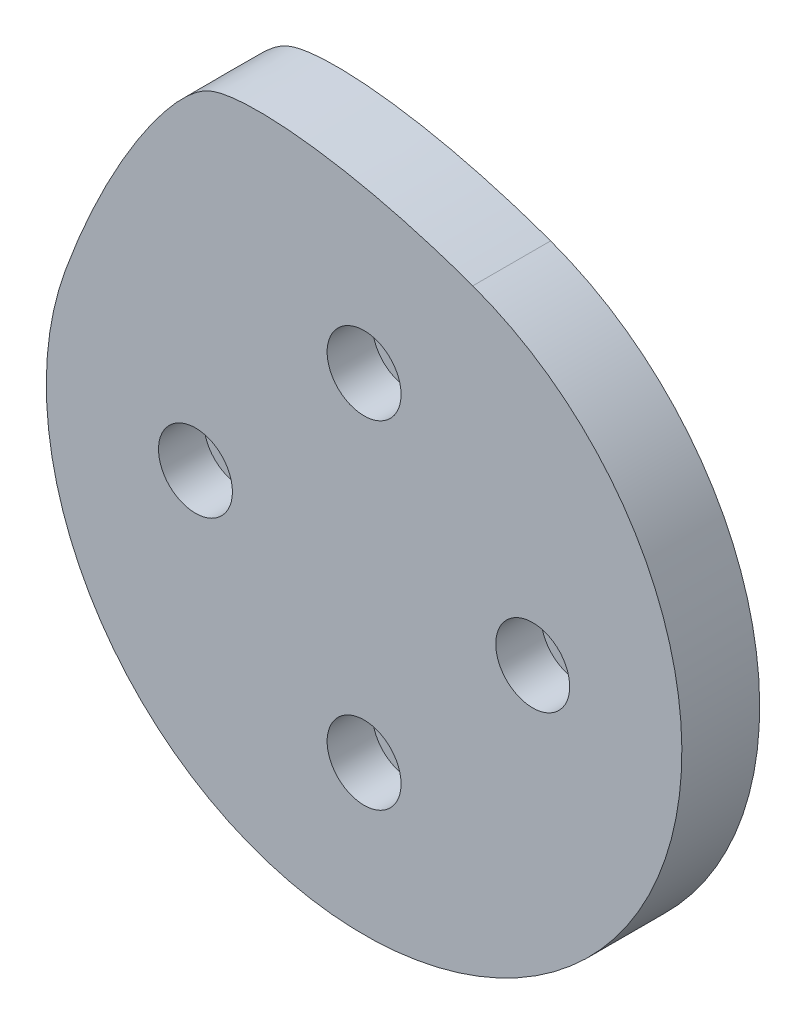
ISO-10303-21;
HEADER;
FILE_DESCRIPTION(('STEP AP214'),'2;1');
FILE_NAME('part.step','',(''),(''),'','','');
FILE_SCHEMA(('AUTOMOTIVE_DESIGN { 1 0 10303 214 1 1 1 1 }'));
ENDSEC;
DATA;
#1=APPLICATION_CONTEXT('core data for automotive mechanical design processes');
#2=APPLICATION_PROTOCOL_DEFINITION('international standard','automotive_design',2000,#1);
#3=PRODUCT_CONTEXT('',#1,'mechanical');
#4=PRODUCT('Part','Part','',(#3));
#5=PRODUCT_RELATED_PRODUCT_CATEGORY('part','',(#4));
#6=PRODUCT_DEFINITION_FORMATION('','',#4);
#7=PRODUCT_DEFINITION_CONTEXT('part definition',#1,'design');
#8=PRODUCT_DEFINITION('design','',#6,#7);
#9=PRODUCT_DEFINITION_SHAPE('','',#8);
#10=(LENGTH_UNIT() NAMED_UNIT(*) SI_UNIT(.MILLI.,.METRE.));
#11=(NAMED_UNIT(*) PLANE_ANGLE_UNIT() SI_UNIT($,.RADIAN.));
#12=(NAMED_UNIT(*) SI_UNIT($,.STERADIAN.) SOLID_ANGLE_UNIT());
#13=UNCERTAINTY_MEASURE_WITH_UNIT(LENGTH_MEASURE(1.E-05),#10,'distance_accuracy_value','');
#14=(GEOMETRIC_REPRESENTATION_CONTEXT(3) GLOBAL_UNCERTAINTY_ASSIGNED_CONTEXT((#13)) GLOBAL_UNIT_ASSIGNED_CONTEXT((#10,
#11,#12)) REPRESENTATION_CONTEXT('',''));
#15=CARTESIAN_POINT('',(0.,0.,0.));
#16=DIRECTION('',(0.,0.,1.));
#17=DIRECTION('',(1.,0.,0.));
#18=AXIS2_PLACEMENT_3D('',#15,#16,#17);
#19=CARTESIAN_POINT('',(-13.,0.,6.));
#20=DIRECTION('',(0.,0.,-1.));
#21=DIRECTION('',(-1.,0.,0.));
#22=AXIS2_PLACEMENT_3D('',#19,#20,#21);
#23=CYLINDRICAL_SURFACE('',#22,2.85);
#24=CARTESIAN_POINT('',(-13.,0.,2.5));
#25=DIRECTION('',(0.,0.,1.));
#26=DIRECTION('',(1.,0.,0.));
#27=AXIS2_PLACEMENT_3D('',#24,#25,#26);
#28=CIRCLE('',#27,2.85);
#29=CARTESIAN_POINT('',(-10.15,0.,2.5));
#30=VERTEX_POINT('',#29);
#31=EDGE_CURVE('E49',#30,#30,#28,.T.);
#32=ORIENTED_EDGE('',*,*,#31,.F.);
#33=EDGE_LOOP('',(#32));
#34=FACE_BOUND('',#33,.T.);
#35=CARTESIAN_POINT('',(-13.,0.,6.));
#36=DIRECTION('',(0.,0.,1.));
#37=DIRECTION('',(1.,0.,0.));
#38=AXIS2_PLACEMENT_3D('',#35,#36,#37);
#39=CIRCLE('',#38,2.85);
#40=CARTESIAN_POINT('',(-10.15,0.,6.));
#41=VERTEX_POINT('',#40);
#42=EDGE_CURVE('E105',#41,#41,#39,.T.);
#43=ORIENTED_EDGE('',*,*,#42,.T.);
#44=EDGE_LOOP('',(#43));
#45=FACE_BOUND('',#44,.T.);
#46=ADVANCED_FACE('F45',(#34,#45),#23,.F.);
#47=CARTESIAN_POINT('',(0.,13.,6.));
#48=DIRECTION('',(0.,0.,-1.));
#49=DIRECTION('',(-1.,0.,0.));
#50=AXIS2_PLACEMENT_3D('',#47,#48,#49);
#51=CYLINDRICAL_SURFACE('',#50,2.85);
#52=CARTESIAN_POINT('',(0.,13.,2.5));
#53=DIRECTION('',(0.,0.,1.));
#54=DIRECTION('',(1.,0.,0.));
#55=AXIS2_PLACEMENT_3D('',#52,#53,#54);
#56=CIRCLE('',#55,2.85);
#57=CARTESIAN_POINT('',(2.85000000000005,13.,2.5));
#58=VERTEX_POINT('',#57);
#59=EDGE_CURVE('E113',#58,#58,#56,.T.);
#60=ORIENTED_EDGE('',*,*,#59,.F.);
#61=EDGE_LOOP('',(#60));
#62=FACE_BOUND('',#61,.T.);
#63=CARTESIAN_POINT('',(0.,13.,6.));
#64=DIRECTION('',(0.,0.,1.));
#65=DIRECTION('',(1.,0.,0.));
#66=AXIS2_PLACEMENT_3D('',#63,#64,#65);
#67=CIRCLE('',#66,2.85);
#68=CARTESIAN_POINT('',(2.85000000000005,13.,6.));
#69=VERTEX_POINT('',#68);
#70=EDGE_CURVE('E102',#69,#69,#67,.T.);
#71=ORIENTED_EDGE('',*,*,#70,.T.);
#72=EDGE_LOOP('',(#71));
#73=FACE_BOUND('',#72,.T.);
#74=ADVANCED_FACE('F124',(#62,#73),#51,.F.);
#75=CARTESIAN_POINT('',(13.,0.,6.));
#76=DIRECTION('',(0.,0.,-1.));
#77=DIRECTION('',(-1.,0.,0.));
#78=AXIS2_PLACEMENT_3D('',#75,#76,#77);
#79=CYLINDRICAL_SURFACE('',#78,2.85);
#80=CARTESIAN_POINT('',(13.,0.,2.5));
#81=DIRECTION('',(0.,0.,1.));
#82=DIRECTION('',(1.,0.,0.));
#83=AXIS2_PLACEMENT_3D('',#80,#81,#82);
#84=CIRCLE('',#83,2.85);
#85=CARTESIAN_POINT('',(15.85,0.,2.5));
#86=VERTEX_POINT('',#85);
#87=EDGE_CURVE('E111',#86,#86,#84,.T.);
#88=ORIENTED_EDGE('',*,*,#87,.F.);
#89=EDGE_LOOP('',(#88));
#90=FACE_BOUND('',#89,.T.);
#91=CARTESIAN_POINT('',(13.,0.,6.));
#92=DIRECTION('',(0.,0.,1.));
#93=DIRECTION('',(1.,0.,0.));
#94=AXIS2_PLACEMENT_3D('',#91,#92,#93);
#95=CIRCLE('',#94,2.85);
#96=CARTESIAN_POINT('',(15.85,0.,6.));
#97=VERTEX_POINT('',#96);
#98=EDGE_CURVE('E99',#97,#97,#95,.T.);
#99=ORIENTED_EDGE('',*,*,#98,.T.);
#100=EDGE_LOOP('',(#99));
#101=FACE_BOUND('',#100,.T.);
#102=ADVANCED_FACE('F139',(#90,#101),#79,.F.);
#103=CARTESIAN_POINT('',(-1.36167772214882E-13,-13.,6.));
#104=DIRECTION('',(0.,0.,-1.));
#105=DIRECTION('',(-1.,0.,0.));
#106=AXIS2_PLACEMENT_3D('',#103,#104,#105);
#107=CYLINDRICAL_SURFACE('',#106,2.85);
#108=CARTESIAN_POINT('',(-1.36167772214882E-13,-13.,2.5));
#109=DIRECTION('',(0.,0.,1.));
#110=DIRECTION('',(1.,0.,0.));
#111=AXIS2_PLACEMENT_3D('',#108,#109,#110);
#112=CIRCLE('',#111,2.85);
#113=CARTESIAN_POINT('',(2.84999999999986,-13.,2.5));
#114=VERTEX_POINT('',#113);
#115=EDGE_CURVE('E108',#114,#114,#112,.T.);
#116=ORIENTED_EDGE('',*,*,#115,.F.);
#117=EDGE_LOOP('',(#116));
#118=FACE_BOUND('',#117,.T.);
#119=CARTESIAN_POINT('',(-1.36167772214882E-13,-13.,6.));
#120=DIRECTION('',(0.,0.,1.));
#121=DIRECTION('',(1.,0.,0.));
#122=AXIS2_PLACEMENT_3D('',#119,#120,#121);
#123=CIRCLE('',#122,2.85);
#124=CARTESIAN_POINT('',(2.84999999999986,-13.,6.));
#125=VERTEX_POINT('',#124);
#126=EDGE_CURVE('E76',#125,#125,#123,.T.);
#127=ORIENTED_EDGE('',*,*,#126,.T.);
#128=EDGE_LOOP('',(#127));
#129=FACE_BOUND('',#128,.T.);
#130=ADVANCED_FACE('F47',(#118,#129),#107,.F.);
#131=CARTESIAN_POINT('',(0.,0.,6.));
#132=DIRECTION('',(0.,0.,1.));
#133=DIRECTION('',(1.,0.,0.));
#134=AXIS2_PLACEMENT_3D('',#131,#132,#133);
#135=PLANE('',#134);
#136=ORIENTED_EDGE('',*,*,#126,.F.);
#137=EDGE_LOOP('',(#136));
#138=FACE_BOUND('',#137,.T.);
#139=ORIENTED_EDGE('',*,*,#98,.F.);
#140=EDGE_LOOP('',(#139));
#141=FACE_BOUND('',#140,.T.);
#142=ORIENTED_EDGE('',*,*,#70,.F.);
#143=EDGE_LOOP('',(#142));
#144=FACE_BOUND('',#143,.T.);
#145=ORIENTED_EDGE('',*,*,#42,.F.);
#146=EDGE_LOOP('',(#145));
#147=FACE_BOUND('',#146,.T.);
#148=CARTESIAN_POINT('',(0.,0.,6.00000000000001));
#149=DIRECTION('',(0.,0.,1.));
#150=DIRECTION('',(1.,0.,0.));
#151=AXIS2_PLACEMENT_3D('',#148,#149,#150);
#152=CIRCLE('',#151,24.5);
#153=CARTESIAN_POINT('',(8.37949351147875,23.0224692092548,6.00000000000001));
#154=VERTEX_POINT('',#153);
#155=CARTESIAN_POINT('',(-23.0224692092548,8.37949351147867,6.00000000000001));
#156=VERTEX_POINT('',#155);
#157=EDGE_CURVE('E60',#154,#156,#152,.F.);
#158=ORIENTED_EDGE('',*,*,#157,.F.);
#159=CARTESIAN_POINT('',(-23.0224692092548,8.37949351147867,6.00000000000001));
#160=CARTESIAN_POINT('',(-19.9442879193239,16.8367270985519,6.00000000000001));
#161=CARTESIAN_POINT('',(-14.7236811956561,24.6247501376525,6.00000000000001));
#162=CARTESIAN_POINT('',(-9.3994531646,27.1074784422976,6.00000000000001));
#163=CARTESIAN_POINT('',(-0.0777400755944418,26.1006504991857,6.00000000000001));
#164=CARTESIAN_POINT('',(8.37949351147875,23.0224692092548,6.00000000000001));
#165=B_SPLINE_CURVE_WITH_KNOTS('',3,(#159,#160,#161,#162,#163,#164),.UNSPECIFIED.,.F.,.F.,(4,1,
1,4),(0.,0.45,0.55,1.),.UNSPECIFIED.);
#166=EDGE_CURVE('E73',#156,#154,#165,.T.);
#167=ORIENTED_EDGE('',*,*,#166,.F.);
#168=EDGE_LOOP('',(#158,#167));
#169=FACE_BOUND('',#168,.T.);
#170=ADVANCED_FACE('F74',(#138,#141,#144,#147,#169),#135,.T.);
#171=CARTESIAN_POINT('',(0.,0.,0.));
#172=DIRECTION('',(0.,0.,1.));
#173=DIRECTION('',(1.,0.,0.));
#174=AXIS2_PLACEMENT_3D('',#171,#172,#173);
#175=PLANE('',#174);
#176=CARTESIAN_POINT('',(0.,0.,0.));
#177=DIRECTION('',(0.,0.,-1.));
#178=DIRECTION('',(-1.,0.,0.));
#179=AXIS2_PLACEMENT_3D('',#176,#177,#178);
#180=CIRCLE('',#179,21.);
#181=CARTESIAN_POINT('',(-21.,0.,0.));
#182=VERTEX_POINT('',#181);
#183=EDGE_CURVE('E12',#182,#182,#180,.T.);
#184=ORIENTED_EDGE('',*,*,#183,.F.);
#185=EDGE_LOOP('',(#184));
#186=FACE_BOUND('',#185,.T.);
#187=CARTESIAN_POINT('',(0.,0.,0.));
#188=DIRECTION('',(0.,0.,-1.));
#189=DIRECTION('',(-1.,0.,0.));
#190=AXIS2_PLACEMENT_3D('',#187,#188,#189);
#191=CIRCLE('',#190,24.5);
#192=CARTESIAN_POINT('',(8.37949351147875,23.0224692092548,0.));
#193=VERTEX_POINT('',#192);
#194=CARTESIAN_POINT('',(-23.0224692092548,8.37949351147867,0.));
#195=VERTEX_POINT('',#194);
#196=EDGE_CURVE('E82',#193,#195,#191,.T.);
#197=ORIENTED_EDGE('',*,*,#196,.T.);
#198=CARTESIAN_POINT('',(-23.0224692092548,8.37949351147867,0.));
#199=CARTESIAN_POINT('',(-19.9442879193239,16.8367270985519,0.));
#200=CARTESIAN_POINT('',(-14.7236811956561,24.6247501376525,0.));
#201=CARTESIAN_POINT('',(-9.3994531646,27.1074784422976,0.));
#202=CARTESIAN_POINT('',(-0.0777400755944418,26.1006504991857,0.));
#203=CARTESIAN_POINT('',(8.37949351147875,23.0224692092548,0.));
#204=B_SPLINE_CURVE_WITH_KNOTS('',3,(#198,#199,#200,#201,#202,#203),.UNSPECIFIED.,.F.,.F.,(4,1,
1,4),(0.,0.45,0.55,1.),.UNSPECIFIED.);
#205=EDGE_CURVE('E87',#195,#193,#204,.T.);
#206=ORIENTED_EDGE('',*,*,#205,.T.);
#207=EDGE_LOOP('',(#197,#206));
#208=FACE_BOUND('',#207,.T.);
#209=ADVANCED_FACE('F129',(#186,#208),#175,.F.);
#210=CARTESIAN_POINT('',(-23.0224692092548,8.37949351147867,77.1641189868336));
#211=CARTESIAN_POINT('',(-19.9442879193239,16.8367270985519,77.1641189868336));
#212=CARTESIAN_POINT('',(-14.7236811956561,24.6247501376525,77.1641189868336));
#213=CARTESIAN_POINT('',(-9.3994531646,27.1074784422976,77.1641189868336));
#214=CARTESIAN_POINT('',(-0.0777400755944418,26.1006504991857,77.1641189868336));
#215=CARTESIAN_POINT('',(8.37949351147875,23.0224692092548,77.1641189868336));
#216=B_SPLINE_CURVE_WITH_KNOTS('',3,(#210,#211,#212,#213,#214,#215),.UNSPECIFIED.,.F.,.F.,(4,1,
1,4),(0.,0.45,0.55,1.),.UNSPECIFIED.);
#217=DIRECTION('',(0.,0.,-1.));
#218=VECTOR('',#217,1.);
#219=SURFACE_OF_LINEAR_EXTRUSION('',#216,#218);
#220=DIRECTION('',(0.,0.,-1.));
#221=VECTOR('',#220,1.);
#222=CARTESIAN_POINT('',(-23.0224692092548,8.37949351147867,77.1641189868336));
#223=LINE('',#222,#221);
#224=EDGE_CURVE('E80',#156,#195,#223,.T.);
#225=ORIENTED_EDGE('',*,*,#224,.F.);
#226=ORIENTED_EDGE('',*,*,#166,.T.);
#227=DIRECTION('',(0.,0.,-1.));
#228=VECTOR('',#227,1.);
#229=CARTESIAN_POINT('',(8.37949351147875,23.0224692092548,77.1641189868336));
#230=LINE('',#229,#228);
#231=EDGE_CURVE('E67',#154,#193,#230,.T.);
#232=ORIENTED_EDGE('',*,*,#231,.T.);
#233=ORIENTED_EDGE('',*,*,#205,.F.);
#234=EDGE_LOOP('',(#225,#226,#232,#233));
#235=FACE_BOUND('',#234,.T.);
#236=ADVANCED_FACE('F85',(#235),#219,.T.);
#237=CARTESIAN_POINT('',(0.,0.,77.1641189868336));
#238=DIRECTION('',(0.,0.,-1.));
#239=DIRECTION('',(-1.,0.,0.));
#240=AXIS2_PLACEMENT_3D('',#237,#238,#239);
#241=CYLINDRICAL_SURFACE('',#240,24.5);
#242=ORIENTED_EDGE('',*,*,#231,.F.);
#243=ORIENTED_EDGE('',*,*,#157,.T.);
#244=ORIENTED_EDGE('',*,*,#224,.T.);
#245=ORIENTED_EDGE('',*,*,#196,.F.);
#246=EDGE_LOOP('',(#242,#243,#244,#245));
#247=FACE_BOUND('',#246,.T.);
#248=ADVANCED_FACE('F79',(#247),#241,.T.);
#249=CARTESIAN_POINT('',(13.,0.,14.0610173055266));
#250=DIRECTION('',(0.,0.,-1.));
#251=DIRECTION('',(-1.,0.,0.));
#252=AXIS2_PLACEMENT_3D('',#249,#250,#251);
#253=CYLINDRICAL_SURFACE('',#252,1.6);
#254=CARTESIAN_POINT('',(13.,0.,2.5));
#255=DIRECTION('',(0.,0.,1.));
#256=DIRECTION('',(1.,0.,0.));
#257=AXIS2_PLACEMENT_3D('',#254,#255,#256);
#258=CIRCLE('',#257,1.6);
#259=CARTESIAN_POINT('',(14.6,0.,2.5));
#260=VERTEX_POINT('',#259);
#261=EDGE_CURVE('E192',#260,#260,#258,.T.);
#262=ORIENTED_EDGE('',*,*,#261,.T.);
#263=EDGE_LOOP('',(#262));
#264=FACE_BOUND('',#263,.T.);
#265=CARTESIAN_POINT('',(13.,0.,-0.5));
#266=DIRECTION('',(0.,0.,-1.));
#267=DIRECTION('',(-1.,0.,0.));
#268=AXIS2_PLACEMENT_3D('',#265,#266,#267);
#269=CIRCLE('',#268,1.6);
#270=CARTESIAN_POINT('',(11.4,0.,-0.5));
#271=VERTEX_POINT('',#270);
#272=EDGE_CURVE('E206',#271,#271,#269,.T.);
#273=ORIENTED_EDGE('',*,*,#272,.T.);
#274=EDGE_LOOP('',(#273));
#275=FACE_BOUND('',#274,.T.);
#276=ADVANCED_FACE('F162',(#264,#275),#253,.F.);
#277=CARTESIAN_POINT('',(0.,0.,2.5));
#278=DIRECTION('',(0.,0.,1.));
#279=DIRECTION('',(1.,0.,0.));
#280=AXIS2_PLACEMENT_3D('',#277,#278,#279);
#281=PLANE('',#280);
#282=ORIENTED_EDGE('',*,*,#261,.F.);
#283=EDGE_LOOP('',(#282));
#284=FACE_BOUND('',#283,.T.);
#285=ORIENTED_EDGE('',*,*,#87,.T.);
#286=EDGE_LOOP('',(#285));
#287=FACE_BOUND('',#286,.T.);
#288=ADVANCED_FACE('F159',(#284,#287),#281,.T.);
#289=CARTESIAN_POINT('',(0.,13.,14.0610173055266));
#290=DIRECTION('',(0.,0.,-1.));
#291=DIRECTION('',(-1.,0.,0.));
#292=AXIS2_PLACEMENT_3D('',#289,#290,#291);
#293=CYLINDRICAL_SURFACE('',#292,1.6);
#294=CARTESIAN_POINT('',(0.,13.,2.5));
#295=DIRECTION('',(0.,0.,1.));
#296=DIRECTION('',(1.,0.,0.));
#297=AXIS2_PLACEMENT_3D('',#294,#295,#296);
#298=CIRCLE('',#297,1.6);
#299=CARTESIAN_POINT('',(1.60000000000005,13.,2.5));
#300=VERTEX_POINT('',#299);
#301=EDGE_CURVE('E195',#300,#300,#298,.T.);
#302=ORIENTED_EDGE('',*,*,#301,.T.);
#303=EDGE_LOOP('',(#302));
#304=FACE_BOUND('',#303,.T.);
#305=CARTESIAN_POINT('',(0.,13.,-0.5));
#306=DIRECTION('',(0.,0.,-1.));
#307=DIRECTION('',(-1.,0.,0.));
#308=AXIS2_PLACEMENT_3D('',#305,#306,#307);
#309=CIRCLE('',#308,1.6);
#310=CARTESIAN_POINT('',(-1.59999999999996,13.,-0.5));
#311=VERTEX_POINT('',#310);
#312=EDGE_CURVE('E215',#311,#311,#309,.T.);
#313=ORIENTED_EDGE('',*,*,#312,.T.);
#314=EDGE_LOOP('',(#313));
#315=FACE_BOUND('',#314,.T.);
#316=ADVANCED_FACE('F161',(#304,#315),#293,.F.);
#317=CARTESIAN_POINT('',(0.,0.,2.5));
#318=DIRECTION('',(0.,0.,1.));
#319=DIRECTION('',(1.,0.,0.));
#320=AXIS2_PLACEMENT_3D('',#317,#318,#319);
#321=PLANE('',#320);
#322=ORIENTED_EDGE('',*,*,#301,.F.);
#323=EDGE_LOOP('',(#322));
#324=FACE_BOUND('',#323,.T.);
#325=ORIENTED_EDGE('',*,*,#59,.T.);
#326=EDGE_LOOP('',(#325));
#327=FACE_BOUND('',#326,.T.);
#328=ADVANCED_FACE('F169',(#324,#327),#321,.T.);
#329=CARTESIAN_POINT('',(-13.,0.,14.0610173055266));
#330=DIRECTION('',(0.,0.,-1.));
#331=DIRECTION('',(-1.,0.,0.));
#332=AXIS2_PLACEMENT_3D('',#329,#330,#331);
#333=CYLINDRICAL_SURFACE('',#332,1.6);
#334=CARTESIAN_POINT('',(-13.,0.,2.5));
#335=DIRECTION('',(0.,0.,1.));
#336=DIRECTION('',(1.,0.,0.));
#337=AXIS2_PLACEMENT_3D('',#334,#335,#336);
#338=CIRCLE('',#337,1.6);
#339=CARTESIAN_POINT('',(-11.4,0.,2.5));
#340=VERTEX_POINT('',#339);
#341=EDGE_CURVE('E199',#340,#340,#338,.T.);
#342=ORIENTED_EDGE('',*,*,#341,.T.);
#343=EDGE_LOOP('',(#342));
#344=FACE_BOUND('',#343,.T.);
#345=CARTESIAN_POINT('',(-13.,0.,-0.5));
#346=DIRECTION('',(0.,0.,-1.));
#347=DIRECTION('',(-1.,0.,0.));
#348=AXIS2_PLACEMENT_3D('',#345,#346,#347);
#349=CIRCLE('',#348,1.6);
#350=CARTESIAN_POINT('',(-14.6,0.,-0.5));
#351=VERTEX_POINT('',#350);
#352=EDGE_CURVE('E212',#351,#351,#349,.T.);
#353=ORIENTED_EDGE('',*,*,#352,.T.);
#354=EDGE_LOOP('',(#353));
#355=FACE_BOUND('',#354,.T.);
#356=ADVANCED_FACE('F241',(#344,#355),#333,.F.);
#357=CARTESIAN_POINT('',(0.,0.,2.5));
#358=DIRECTION('',(0.,0.,1.));
#359=DIRECTION('',(1.,0.,0.));
#360=AXIS2_PLACEMENT_3D('',#357,#358,#359);
#361=PLANE('',#360);
#362=ORIENTED_EDGE('',*,*,#341,.F.);
#363=EDGE_LOOP('',(#362));
#364=FACE_BOUND('',#363,.T.);
#365=ORIENTED_EDGE('',*,*,#31,.T.);
#366=EDGE_LOOP('',(#365));
#367=FACE_BOUND('',#366,.T.);
#368=ADVANCED_FACE('F120',(#364,#367),#361,.T.);
#369=CARTESIAN_POINT('',(-1.36167772214882E-13,-13.,14.0610173055266));
#370=DIRECTION('',(0.,0.,-1.));
#371=DIRECTION('',(-1.,0.,0.));
#372=AXIS2_PLACEMENT_3D('',#369,#370,#371);
#373=CYLINDRICAL_SURFACE('',#372,1.6);
#374=CARTESIAN_POINT('',(-1.36167772214882E-13,-13.,2.5));
#375=DIRECTION('',(0.,0.,1.));
#376=DIRECTION('',(1.,0.,0.));
#377=AXIS2_PLACEMENT_3D('',#374,#375,#376);
#378=CIRCLE('',#377,1.6);
#379=CARTESIAN_POINT('',(1.59999999999986,-13.,2.5));
#380=VERTEX_POINT('',#379);
#381=EDGE_CURVE('E83',#380,#380,#378,.T.);
#382=ORIENTED_EDGE('',*,*,#381,.T.);
#383=EDGE_LOOP('',(#382));
#384=FACE_BOUND('',#383,.T.);
#385=CARTESIAN_POINT('',(-1.36167772214882E-13,-13.,-0.5));
#386=DIRECTION('',(0.,0.,-1.));
#387=DIRECTION('',(-1.,0.,0.));
#388=AXIS2_PLACEMENT_3D('',#385,#386,#387);
#389=CIRCLE('',#388,1.6);
#390=CARTESIAN_POINT('',(-1.60000000000014,-13.,-0.5));
#391=VERTEX_POINT('',#390);
#392=EDGE_CURVE('E209',#391,#391,#389,.T.);
#393=ORIENTED_EDGE('',*,*,#392,.T.);
#394=EDGE_LOOP('',(#393));
#395=FACE_BOUND('',#394,.T.);
#396=ADVANCED_FACE('F233',(#384,#395),#373,.F.);
#397=CARTESIAN_POINT('',(0.,0.,2.5));
#398=DIRECTION('',(0.,0.,1.));
#399=DIRECTION('',(1.,0.,0.));
#400=AXIS2_PLACEMENT_3D('',#397,#398,#399);
#401=PLANE('',#400);
#402=ORIENTED_EDGE('',*,*,#381,.F.);
#403=EDGE_LOOP('',(#402));
#404=FACE_BOUND('',#403,.T.);
#405=ORIENTED_EDGE('',*,*,#115,.T.);
#406=EDGE_LOOP('',(#405));
#407=FACE_BOUND('',#406,.T.);
#408=ADVANCED_FACE('F223',(#404,#407),#401,.T.);
#409=CARTESIAN_POINT('',(0.,0.,-0.5));
#410=DIRECTION('',(0.,0.,-1.));
#411=DIRECTION('',(-1.,0.,0.));
#412=AXIS2_PLACEMENT_3D('',#409,#410,#411);
#413=PLANE('',#412);
#414=ORIENTED_EDGE('',*,*,#352,.F.);
#415=EDGE_LOOP('',(#414));
#416=FACE_BOUND('',#415,.T.);
#417=ORIENTED_EDGE('',*,*,#272,.F.);
#418=EDGE_LOOP('',(#417));
#419=FACE_BOUND('',#418,.T.);
#420=CARTESIAN_POINT('',(0.,0.,-0.5));
#421=DIRECTION('',(0.,0.,-1.));
#422=DIRECTION('',(-1.,0.,0.));
#423=AXIS2_PLACEMENT_3D('',#420,#421,#422);
#424=CIRCLE('',#423,21.);
#425=CARTESIAN_POINT('',(-21.,0.,-0.5));
#426=VERTEX_POINT('',#425);
#427=EDGE_CURVE('E196',#426,#426,#424,.T.);
#428=ORIENTED_EDGE('',*,*,#427,.T.);
#429=EDGE_LOOP('',(#428));
#430=FACE_BOUND('',#429,.T.);
#431=ORIENTED_EDGE('',*,*,#392,.F.);
#432=EDGE_LOOP('',(#431));
#433=FACE_BOUND('',#432,.T.);
#434=ORIENTED_EDGE('',*,*,#312,.F.);
#435=EDGE_LOOP('',(#434));
#436=FACE_BOUND('',#435,.T.);
#437=ADVANCED_FACE('F220',(#416,#419,#430,#433,#436),#413,.T.);
#438=CARTESIAN_POINT('',(0.,0.,-0.5));
#439=DIRECTION('',(0.,0.,1.));
#440=DIRECTION('',(1.,0.,0.));
#441=AXIS2_PLACEMENT_3D('',#438,#439,#440);
#442=CYLINDRICAL_SURFACE('',#441,21.);
#443=ORIENTED_EDGE('',*,*,#427,.F.);
#444=EDGE_LOOP('',(#443));
#445=FACE_BOUND('',#444,.T.);
#446=ORIENTED_EDGE('',*,*,#183,.T.);
#447=EDGE_LOOP('',(#446));
#448=FACE_BOUND('',#447,.T.);
#449=ADVANCED_FACE('F222',(#445,#448),#442,.T.);
#450=CLOSED_SHELL('',(#46,#74,#102,#130,#170,#209,#236,#248,#276,#288,#316,#328,#356,#368,#396,
#408,#437,#449));
#451=MANIFOLD_SOLID_BREP('B2',#450);
#452=ADVANCED_BREP_SHAPE_REPRESENTATION('',(#18,#451),#14);
#453=SHAPE_DEFINITION_REPRESENTATION(#9,#452);
ENDSEC;
END-ISO-10303-21;
